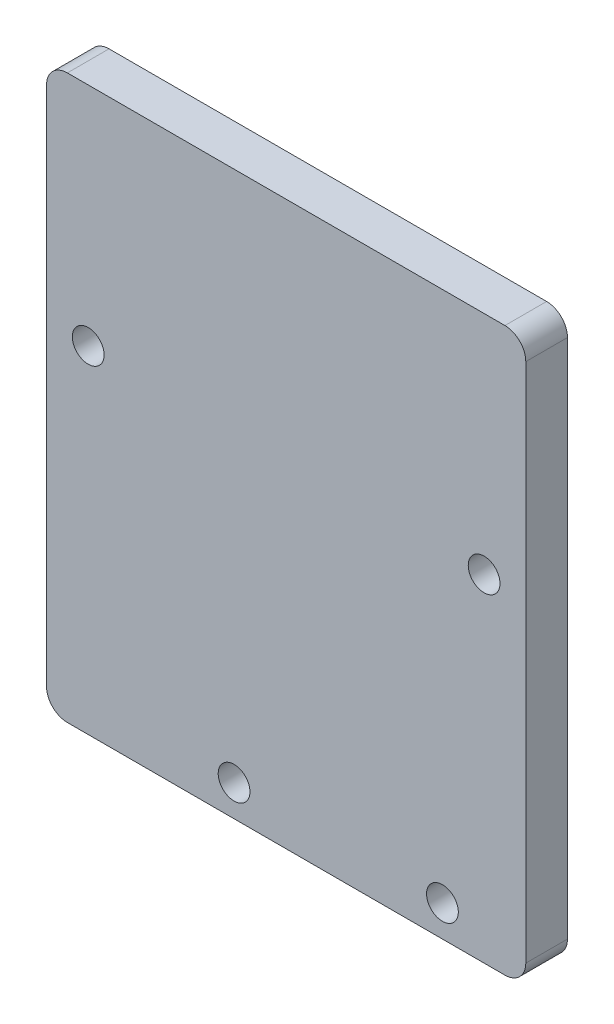
ISO-10303-21;
HEADER;
FILE_DESCRIPTION(('STEP AP214'),'2;1');
FILE_NAME('part.step','',(''),(''),'','','');
FILE_SCHEMA(('AUTOMOTIVE_DESIGN { 1 0 10303 214 1 1 1 1 }'));
ENDSEC;
DATA;
#1=APPLICATION_CONTEXT('core data for automotive mechanical design processes');
#2=APPLICATION_PROTOCOL_DEFINITION('international standard','automotive_design',2000,#1);
#3=PRODUCT_CONTEXT('',#1,'mechanical');
#4=PRODUCT('Part','Part','',(#3));
#5=PRODUCT_RELATED_PRODUCT_CATEGORY('part','',(#4));
#6=PRODUCT_DEFINITION_FORMATION('','',#4);
#7=PRODUCT_DEFINITION_CONTEXT('part definition',#1,'design');
#8=PRODUCT_DEFINITION('design','',#6,#7);
#9=PRODUCT_DEFINITION_SHAPE('','',#8);
#10=(LENGTH_UNIT() NAMED_UNIT(*) SI_UNIT(.MILLI.,.METRE.));
#11=(NAMED_UNIT(*) PLANE_ANGLE_UNIT() SI_UNIT($,.RADIAN.));
#12=(NAMED_UNIT(*) SI_UNIT($,.STERADIAN.) SOLID_ANGLE_UNIT());
#13=UNCERTAINTY_MEASURE_WITH_UNIT(LENGTH_MEASURE(1.E-05),#10,'distance_accuracy_value','');
#14=(GEOMETRIC_REPRESENTATION_CONTEXT(3) GLOBAL_UNCERTAINTY_ASSIGNED_CONTEXT((#13)) GLOBAL_UNIT_ASSIGNED_CONTEXT((#10,
#11,#12)) REPRESENTATION_CONTEXT('',''));
#15=CARTESIAN_POINT('',(0.,0.,0.));
#16=DIRECTION('',(0.,0.,1.));
#17=DIRECTION('',(1.,0.,0.));
#18=AXIS2_PLACEMENT_3D('',#15,#16,#17);
#19=CARTESIAN_POINT('',(23.,-27.,4.));
#20=DIRECTION('',(-1.,0.,0.));
#21=DIRECTION('',(0.,0.,1.));
#22=AXIS2_PLACEMENT_3D('',#19,#20,#21);
#23=PLANE('',#22);
#24=DIRECTION('',(0.,1.,0.));
#25=VECTOR('',#24,1.);
#26=CARTESIAN_POINT('',(23.,-27.,0.));
#27=LINE('',#26,#25);
#28=CARTESIAN_POINT('',(23.,-25.,0.));
#29=VERTEX_POINT('',#28);
#30=CARTESIAN_POINT('',(23.,25.,0.));
#31=VERTEX_POINT('',#30);
#32=EDGE_CURVE('E132',#29,#31,#27,.T.);
#33=ORIENTED_EDGE('',*,*,#32,.T.);
#34=DIRECTION('',(0.,0.,-1.));
#35=VECTOR('',#34,1.);
#36=CARTESIAN_POINT('',(23.,25.,4.));
#37=LINE('',#36,#35);
#38=CARTESIAN_POINT('',(23.,25.,4.));
#39=VERTEX_POINT('',#38);
#40=EDGE_CURVE('E155',#31,#39,#37,.F.);
#41=ORIENTED_EDGE('',*,*,#40,.T.);
#42=DIRECTION('',(0.,1.,0.));
#43=VECTOR('',#42,1.);
#44=CARTESIAN_POINT('',(23.,-27.,4.));
#45=LINE('',#44,#43);
#46=CARTESIAN_POINT('',(23.,-25.,4.));
#47=VERTEX_POINT('',#46);
#48=EDGE_CURVE('E130',#47,#39,#45,.T.);
#49=ORIENTED_EDGE('',*,*,#48,.F.);
#50=DIRECTION('',(0.,0.,-1.));
#51=VECTOR('',#50,1.);
#52=CARTESIAN_POINT('',(23.,-25.,4.));
#53=LINE('',#52,#51);
#54=EDGE_CURVE('E152',#47,#29,#53,.T.);
#55=ORIENTED_EDGE('',*,*,#54,.T.);
#56=EDGE_LOOP('',(#33,#41,#49,#55));
#57=FACE_BOUND('',#56,.T.);
#58=ADVANCED_FACE('F37',(#57),#23,.F.);
#59=CARTESIAN_POINT('',(-23.,27.,4.));
#60=DIRECTION('',(0.,-1.,0.));
#61=DIRECTION('',(0.,0.,-1.));
#62=AXIS2_PLACEMENT_3D('',#59,#60,#61);
#63=PLANE('',#62);
#64=DIRECTION('',(-1.,0.,0.));
#65=VECTOR('',#64,1.);
#66=CARTESIAN_POINT('',(-23.,27.,0.));
#67=LINE('',#66,#65);
#68=CARTESIAN_POINT('',(21.,27.,0.));
#69=VERTEX_POINT('',#68);
#70=CARTESIAN_POINT('',(-21.,27.,0.));
#71=VERTEX_POINT('',#70);
#72=EDGE_CURVE('E128',#69,#71,#67,.T.);
#73=ORIENTED_EDGE('',*,*,#72,.T.);
#74=DIRECTION('',(0.,0.,-1.));
#75=VECTOR('',#74,1.);
#76=CARTESIAN_POINT('',(-21.,27.,4.));
#77=LINE('',#76,#75);
#78=CARTESIAN_POINT('',(-21.,27.,4.));
#79=VERTEX_POINT('',#78);
#80=EDGE_CURVE('E107',#71,#79,#77,.F.);
#81=ORIENTED_EDGE('',*,*,#80,.T.);
#82=DIRECTION('',(-1.,0.,0.));
#83=VECTOR('',#82,1.);
#84=CARTESIAN_POINT('',(-23.,27.,4.));
#85=LINE('',#84,#83);
#86=CARTESIAN_POINT('',(21.,27.,4.));
#87=VERTEX_POINT('',#86);
#88=EDGE_CURVE('E171',#87,#79,#85,.T.);
#89=ORIENTED_EDGE('',*,*,#88,.F.);
#90=DIRECTION('',(0.,0.,-1.));
#91=VECTOR('',#90,1.);
#92=CARTESIAN_POINT('',(21.,27.,4.));
#93=LINE('',#92,#91);
#94=EDGE_CURVE('E112',#87,#69,#93,.T.);
#95=ORIENTED_EDGE('',*,*,#94,.T.);
#96=EDGE_LOOP('',(#73,#81,#89,#95));
#97=FACE_BOUND('',#96,.T.);
#98=ADVANCED_FACE('F228',(#97),#63,.F.);
#99=CARTESIAN_POINT('',(-23.,-27.,4.));
#100=DIRECTION('',(1.,0.,0.));
#101=DIRECTION('',(0.,0.,-1.));
#102=AXIS2_PLACEMENT_3D('',#99,#100,#101);
#103=PLANE('',#102);
#104=DIRECTION('',(0.,-1.,0.));
#105=VECTOR('',#104,1.);
#106=CARTESIAN_POINT('',(-23.,-27.,4.));
#107=LINE('',#106,#105);
#108=CARTESIAN_POINT('',(-23.,25.,4.));
#109=VERTEX_POINT('',#108);
#110=CARTESIAN_POINT('',(-23.,-25.,4.));
#111=VERTEX_POINT('',#110);
#112=EDGE_CURVE('E121',#109,#111,#107,.T.);
#113=ORIENTED_EDGE('',*,*,#112,.F.);
#114=DIRECTION('',(0.,0.,-1.));
#115=VECTOR('',#114,1.);
#116=CARTESIAN_POINT('',(-23.,25.,4.));
#117=LINE('',#116,#115);
#118=CARTESIAN_POINT('',(-23.,25.,0.));
#119=VERTEX_POINT('',#118);
#120=EDGE_CURVE('E106',#109,#119,#117,.T.);
#121=ORIENTED_EDGE('',*,*,#120,.T.);
#122=DIRECTION('',(0.,-1.,0.));
#123=VECTOR('',#122,1.);
#124=CARTESIAN_POINT('',(-23.,-27.,0.));
#125=LINE('',#124,#123);
#126=CARTESIAN_POINT('',(-23.,-25.,0.));
#127=VERTEX_POINT('',#126);
#128=EDGE_CURVE('E119',#119,#127,#125,.T.);
#129=ORIENTED_EDGE('',*,*,#128,.T.);
#130=DIRECTION('',(0.,0.,-1.));
#131=VECTOR('',#130,1.);
#132=CARTESIAN_POINT('',(-23.,-25.,4.));
#133=LINE('',#132,#131);
#134=EDGE_CURVE('E123',#127,#111,#133,.F.);
#135=ORIENTED_EDGE('',*,*,#134,.T.);
#136=EDGE_LOOP('',(#113,#121,#129,#135));
#137=FACE_BOUND('',#136,.T.);
#138=ADVANCED_FACE('F118',(#137),#103,.F.);
#139=CARTESIAN_POINT('',(-23.,-27.,4.));
#140=DIRECTION('',(0.,1.,0.));
#141=DIRECTION('',(0.,0.,1.));
#142=AXIS2_PLACEMENT_3D('',#139,#140,#141);
#143=PLANE('',#142);
#144=DIRECTION('',(1.,0.,0.));
#145=VECTOR('',#144,1.);
#146=CARTESIAN_POINT('',(-23.,-27.,0.));
#147=LINE('',#146,#145);
#148=CARTESIAN_POINT('',(-21.,-27.,0.));
#149=VERTEX_POINT('',#148);
#150=CARTESIAN_POINT('',(21.,-27.,0.));
#151=VERTEX_POINT('',#150);
#152=EDGE_CURVE('E127',#149,#151,#147,.T.);
#153=ORIENTED_EDGE('',*,*,#152,.T.);
#154=DIRECTION('',(0.,0.,-1.));
#155=VECTOR('',#154,1.);
#156=CARTESIAN_POINT('',(21.,-27.,4.));
#157=LINE('',#156,#155);
#158=CARTESIAN_POINT('',(21.,-27.,4.));
#159=VERTEX_POINT('',#158);
#160=EDGE_CURVE('E11',#151,#159,#157,.F.);
#161=ORIENTED_EDGE('',*,*,#160,.T.);
#162=DIRECTION('',(1.,0.,0.));
#163=VECTOR('',#162,1.);
#164=CARTESIAN_POINT('',(-23.,-27.,4.));
#165=LINE('',#164,#163);
#166=CARTESIAN_POINT('',(-21.,-27.,4.));
#167=VERTEX_POINT('',#166);
#168=EDGE_CURVE('E136',#167,#159,#165,.T.);
#169=ORIENTED_EDGE('',*,*,#168,.F.);
#170=DIRECTION('',(0.,0.,-1.));
#171=VECTOR('',#170,1.);
#172=CARTESIAN_POINT('',(-21.,-27.,4.));
#173=LINE('',#172,#171);
#174=EDGE_CURVE('E45',#167,#149,#173,.T.);
#175=ORIENTED_EDGE('',*,*,#174,.T.);
#176=EDGE_LOOP('',(#153,#161,#169,#175));
#177=FACE_BOUND('',#176,.T.);
#178=ADVANCED_FACE('F158',(#177),#143,.F.);
#179=CARTESIAN_POINT('',(0.,0.,4.));
#180=DIRECTION('',(0.,0.,-1.));
#181=DIRECTION('',(-1.,0.,0.));
#182=AXIS2_PLACEMENT_3D('',#179,#180,#181);
#183=PLANE('',#182);
#184=CARTESIAN_POINT('',(-19.,5.31031044755148,4.));
#185=DIRECTION('',(0.,0.,-1.));
#186=DIRECTION('',(-1.,0.,0.));
#187=AXIS2_PLACEMENT_3D('',#184,#185,#186);
#188=CIRCLE('',#187,1.525);
#189=CARTESIAN_POINT('',(-20.525,5.31031044755148,4.));
#190=VERTEX_POINT('',#189);
#191=EDGE_CURVE('E176',#190,#190,#188,.T.);
#192=ORIENTED_EDGE('',*,*,#191,.T.);
#193=EDGE_LOOP('',(#192));
#194=FACE_BOUND('',#193,.T.);
#195=CARTESIAN_POINT('',(19.,5.31031044755147,4.));
#196=DIRECTION('',(0.,0.,-1.));
#197=DIRECTION('',(-1.,0.,0.));
#198=AXIS2_PLACEMENT_3D('',#195,#196,#197);
#199=CIRCLE('',#198,1.525);
#200=CARTESIAN_POINT('',(17.475,5.31031044755147,4.));
#201=VERTEX_POINT('',#200);
#202=EDGE_CURVE('E181',#201,#201,#199,.T.);
#203=ORIENTED_EDGE('',*,*,#202,.T.);
#204=EDGE_LOOP('',(#203));
#205=FACE_BOUND('',#204,.T.);
#206=CARTESIAN_POINT('',(15.,-24.,4.));
#207=DIRECTION('',(0.,0.,-1.));
#208=DIRECTION('',(-1.,0.,0.));
#209=AXIS2_PLACEMENT_3D('',#206,#207,#208);
#210=CIRCLE('',#209,1.525);
#211=CARTESIAN_POINT('',(13.475,-24.,4.));
#212=VERTEX_POINT('',#211);
#213=EDGE_CURVE('E185',#212,#212,#210,.T.);
#214=ORIENTED_EDGE('',*,*,#213,.T.);
#215=EDGE_LOOP('',(#214));
#216=FACE_BOUND('',#215,.T.);
#217=CARTESIAN_POINT('',(-4.99999999999995,-24.,4.));
#218=DIRECTION('',(0.,0.,-1.));
#219=DIRECTION('',(-1.,0.,0.));
#220=AXIS2_PLACEMENT_3D('',#217,#218,#219);
#221=CIRCLE('',#220,1.525);
#222=CARTESIAN_POINT('',(-6.52499999999995,-24.,4.));
#223=VERTEX_POINT('',#222);
#224=EDGE_CURVE('E189',#223,#223,#221,.T.);
#225=ORIENTED_EDGE('',*,*,#224,.T.);
#226=EDGE_LOOP('',(#225));
#227=FACE_BOUND('',#226,.T.);
#228=ORIENTED_EDGE('',*,*,#88,.T.);
#229=CARTESIAN_POINT('',(-21.,25.,4.));
#230=DIRECTION('',(0.,0.,-1.));
#231=DIRECTION('',(-1.,0.,0.));
#232=AXIS2_PLACEMENT_3D('',#229,#230,#231);
#233=CIRCLE('',#232,2.);
#234=EDGE_CURVE('E150',#79,#109,#233,.F.);
#235=ORIENTED_EDGE('',*,*,#234,.T.);
#236=ORIENTED_EDGE('',*,*,#112,.T.);
#237=CARTESIAN_POINT('',(-21.,-25.,4.));
#238=DIRECTION('',(0.,0.,-1.));
#239=DIRECTION('',(-1.,0.,0.));
#240=AXIS2_PLACEMENT_3D('',#237,#238,#239);
#241=CIRCLE('',#240,2.);
#242=EDGE_CURVE('E57',#111,#167,#241,.F.);
#243=ORIENTED_EDGE('',*,*,#242,.T.);
#244=ORIENTED_EDGE('',*,*,#168,.T.);
#245=CARTESIAN_POINT('',(21.,-25.,4.));
#246=DIRECTION('',(0.,0.,-1.));
#247=DIRECTION('',(-1.,0.,0.));
#248=AXIS2_PLACEMENT_3D('',#245,#246,#247);
#249=CIRCLE('',#248,2.);
#250=EDGE_CURVE('E146',#159,#47,#249,.F.);
#251=ORIENTED_EDGE('',*,*,#250,.T.);
#252=ORIENTED_EDGE('',*,*,#48,.T.);
#253=CARTESIAN_POINT('',(21.,25.,4.));
#254=DIRECTION('',(0.,0.,-1.));
#255=DIRECTION('',(-1.,0.,0.));
#256=AXIS2_PLACEMENT_3D('',#253,#254,#255);
#257=CIRCLE('',#256,2.);
#258=EDGE_CURVE('E148',#39,#87,#257,.F.);
#259=ORIENTED_EDGE('',*,*,#258,.T.);
#260=EDGE_LOOP('',(#228,#235,#236,#243,#244,#251,#252,#259));
#261=FACE_BOUND('',#260,.T.);
#262=ADVANCED_FACE('F213',(#194,#205,#216,#227,#261),#183,.F.);
#263=CARTESIAN_POINT('',(0.,0.,0.));
#264=DIRECTION('',(0.,0.,-1.));
#265=DIRECTION('',(-1.,0.,0.));
#266=AXIS2_PLACEMENT_3D('',#263,#264,#265);
#267=PLANE('',#266);
#268=CARTESIAN_POINT('',(-19.,5.31031044755148,0.));
#269=DIRECTION('',(0.,0.,-1.));
#270=DIRECTION('',(-1.,0.,0.));
#271=AXIS2_PLACEMENT_3D('',#268,#269,#270);
#272=CIRCLE('',#271,1.525);
#273=CARTESIAN_POINT('',(-20.525,5.31031044755148,0.));
#274=VERTEX_POINT('',#273);
#275=EDGE_CURVE('E198',#274,#274,#272,.T.);
#276=ORIENTED_EDGE('',*,*,#275,.F.);
#277=EDGE_LOOP('',(#276));
#278=FACE_BOUND('',#277,.T.);
#279=CARTESIAN_POINT('',(19.,5.31031044755147,0.));
#280=DIRECTION('',(0.,0.,-1.));
#281=DIRECTION('',(-1.,0.,0.));
#282=AXIS2_PLACEMENT_3D('',#279,#280,#281);
#283=CIRCLE('',#282,1.525);
#284=CARTESIAN_POINT('',(17.475,5.31031044755147,0.));
#285=VERTEX_POINT('',#284);
#286=EDGE_CURVE('E201',#285,#285,#283,.T.);
#287=ORIENTED_EDGE('',*,*,#286,.F.);
#288=EDGE_LOOP('',(#287));
#289=FACE_BOUND('',#288,.T.);
#290=CARTESIAN_POINT('',(15.,-24.,0.));
#291=DIRECTION('',(0.,0.,-1.));
#292=DIRECTION('',(-1.,0.,0.));
#293=AXIS2_PLACEMENT_3D('',#290,#291,#292);
#294=CIRCLE('',#293,1.525);
#295=CARTESIAN_POINT('',(13.475,-24.,0.));
#296=VERTEX_POINT('',#295);
#297=EDGE_CURVE('E197',#296,#296,#294,.T.);
#298=ORIENTED_EDGE('',*,*,#297,.F.);
#299=EDGE_LOOP('',(#298));
#300=FACE_BOUND('',#299,.T.);
#301=CARTESIAN_POINT('',(-4.99999999999995,-24.,0.));
#302=DIRECTION('',(0.,0.,-1.));
#303=DIRECTION('',(-1.,0.,0.));
#304=AXIS2_PLACEMENT_3D('',#301,#302,#303);
#305=CIRCLE('',#304,1.525);
#306=CARTESIAN_POINT('',(-6.52499999999995,-24.,0.));
#307=VERTEX_POINT('',#306);
#308=EDGE_CURVE('E194',#307,#307,#305,.T.);
#309=ORIENTED_EDGE('',*,*,#308,.F.);
#310=EDGE_LOOP('',(#309));
#311=FACE_BOUND('',#310,.T.);
#312=ORIENTED_EDGE('',*,*,#128,.F.);
#313=CARTESIAN_POINT('',(-21.,25.,0.));
#314=DIRECTION('',(0.,0.,-1.));
#315=DIRECTION('',(-1.,0.,0.));
#316=AXIS2_PLACEMENT_3D('',#313,#314,#315);
#317=CIRCLE('',#316,2.);
#318=EDGE_CURVE('E102',#119,#71,#317,.T.);
#319=ORIENTED_EDGE('',*,*,#318,.T.);
#320=ORIENTED_EDGE('',*,*,#72,.F.);
#321=CARTESIAN_POINT('',(21.,25.,0.));
#322=DIRECTION('',(0.,0.,-1.));
#323=DIRECTION('',(-1.,0.,0.));
#324=AXIS2_PLACEMENT_3D('',#321,#322,#323);
#325=CIRCLE('',#324,2.);
#326=EDGE_CURVE('E113',#69,#31,#325,.T.);
#327=ORIENTED_EDGE('',*,*,#326,.T.);
#328=ORIENTED_EDGE('',*,*,#32,.F.);
#329=CARTESIAN_POINT('',(21.,-25.,0.));
#330=DIRECTION('',(0.,0.,-1.));
#331=DIRECTION('',(-1.,0.,0.));
#332=AXIS2_PLACEMENT_3D('',#329,#330,#331);
#333=CIRCLE('',#332,2.);
#334=EDGE_CURVE('E139',#29,#151,#333,.T.);
#335=ORIENTED_EDGE('',*,*,#334,.T.);
#336=ORIENTED_EDGE('',*,*,#152,.F.);
#337=CARTESIAN_POINT('',(-21.,-25.,0.));
#338=DIRECTION('',(0.,0.,-1.));
#339=DIRECTION('',(-1.,0.,0.));
#340=AXIS2_PLACEMENT_3D('',#337,#338,#339);
#341=CIRCLE('',#340,2.);
#342=EDGE_CURVE('E122',#149,#127,#341,.T.);
#343=ORIENTED_EDGE('',*,*,#342,.T.);
#344=EDGE_LOOP('',(#312,#319,#320,#327,#328,#335,#336,#343));
#345=FACE_BOUND('',#344,.T.);
#346=ADVANCED_FACE('F125',(#278,#289,#300,#311,#345),#267,.T.);
#347=CARTESIAN_POINT('',(-4.99999999999995,-24.,54.));
#348=DIRECTION('',(0.,0.,-1.));
#349=DIRECTION('',(-1.,0.,0.));
#350=AXIS2_PLACEMENT_3D('',#347,#348,#349);
#351=CYLINDRICAL_SURFACE('',#350,1.525);
#352=ORIENTED_EDGE('',*,*,#308,.T.);
#353=EDGE_LOOP('',(#352));
#354=FACE_BOUND('',#353,.T.);
#355=ORIENTED_EDGE('',*,*,#224,.F.);
#356=EDGE_LOOP('',(#355));
#357=FACE_BOUND('',#356,.T.);
#358=ADVANCED_FACE('F212',(#354,#357),#351,.F.);
#359=CARTESIAN_POINT('',(15.,-24.,54.));
#360=DIRECTION('',(0.,0.,-1.));
#361=DIRECTION('',(-1.,0.,0.));
#362=AXIS2_PLACEMENT_3D('',#359,#360,#361);
#363=CYLINDRICAL_SURFACE('',#362,1.525);
#364=ORIENTED_EDGE('',*,*,#297,.T.);
#365=EDGE_LOOP('',(#364));
#366=FACE_BOUND('',#365,.T.);
#367=ORIENTED_EDGE('',*,*,#213,.F.);
#368=EDGE_LOOP('',(#367));
#369=FACE_BOUND('',#368,.T.);
#370=ADVANCED_FACE('F207',(#366,#369),#363,.F.);
#371=CARTESIAN_POINT('',(19.,5.31031044755147,54.));
#372=DIRECTION('',(0.,0.,-1.));
#373=DIRECTION('',(-1.,0.,0.));
#374=AXIS2_PLACEMENT_3D('',#371,#372,#373);
#375=CYLINDRICAL_SURFACE('',#374,1.525);
#376=ORIENTED_EDGE('',*,*,#286,.T.);
#377=EDGE_LOOP('',(#376));
#378=FACE_BOUND('',#377,.T.);
#379=ORIENTED_EDGE('',*,*,#202,.F.);
#380=EDGE_LOOP('',(#379));
#381=FACE_BOUND('',#380,.T.);
#382=ADVANCED_FACE('F253',(#378,#381),#375,.F.);
#383=CARTESIAN_POINT('',(-19.,5.31031044755148,54.));
#384=DIRECTION('',(0.,0.,-1.));
#385=DIRECTION('',(-1.,0.,0.));
#386=AXIS2_PLACEMENT_3D('',#383,#384,#385);
#387=CYLINDRICAL_SURFACE('',#386,1.525);
#388=ORIENTED_EDGE('',*,*,#275,.T.);
#389=EDGE_LOOP('',(#388));
#390=FACE_BOUND('',#389,.T.);
#391=ORIENTED_EDGE('',*,*,#191,.F.);
#392=EDGE_LOOP('',(#391));
#393=FACE_BOUND('',#392,.T.);
#394=ADVANCED_FACE('F237',(#390,#393),#387,.F.);
#395=CARTESIAN_POINT('',(-21.,25.,4.));
#396=DIRECTION('',(0.,0.,-1.));
#397=DIRECTION('',(-1.,0.,0.));
#398=AXIS2_PLACEMENT_3D('',#395,#396,#397);
#399=CYLINDRICAL_SURFACE('',#398,2.);
#400=ORIENTED_EDGE('',*,*,#234,.F.);
#401=ORIENTED_EDGE('',*,*,#80,.F.);
#402=ORIENTED_EDGE('',*,*,#318,.F.);
#403=ORIENTED_EDGE('',*,*,#120,.F.);
#404=EDGE_LOOP('',(#400,#401,#402,#403));
#405=FACE_BOUND('',#404,.T.);
#406=ADVANCED_FACE('F105',(#405),#399,.T.);
#407=CARTESIAN_POINT('',(21.,25.,4.));
#408=DIRECTION('',(0.,0.,-1.));
#409=DIRECTION('',(-1.,0.,0.));
#410=AXIS2_PLACEMENT_3D('',#407,#408,#409);
#411=CYLINDRICAL_SURFACE('',#410,2.);
#412=ORIENTED_EDGE('',*,*,#258,.F.);
#413=ORIENTED_EDGE('',*,*,#40,.F.);
#414=ORIENTED_EDGE('',*,*,#326,.F.);
#415=ORIENTED_EDGE('',*,*,#94,.F.);
#416=EDGE_LOOP('',(#412,#413,#414,#415));
#417=FACE_BOUND('',#416,.T.);
#418=ADVANCED_FACE('F230',(#417),#411,.T.);
#419=CARTESIAN_POINT('',(21.,-25.,4.));
#420=DIRECTION('',(0.,0.,-1.));
#421=DIRECTION('',(-1.,0.,0.));
#422=AXIS2_PLACEMENT_3D('',#419,#420,#421);
#423=CYLINDRICAL_SURFACE('',#422,2.);
#424=ORIENTED_EDGE('',*,*,#250,.F.);
#425=ORIENTED_EDGE('',*,*,#160,.F.);
#426=ORIENTED_EDGE('',*,*,#334,.F.);
#427=ORIENTED_EDGE('',*,*,#54,.F.);
#428=EDGE_LOOP('',(#424,#425,#426,#427));
#429=FACE_BOUND('',#428,.T.);
#430=ADVANCED_FACE('F165',(#429),#423,.T.);
#431=CARTESIAN_POINT('',(-21.,-25.,4.));
#432=DIRECTION('',(0.,0.,-1.));
#433=DIRECTION('',(-1.,0.,0.));
#434=AXIS2_PLACEMENT_3D('',#431,#432,#433);
#435=CYLINDRICAL_SURFACE('',#434,2.);
#436=ORIENTED_EDGE('',*,*,#242,.F.);
#437=ORIENTED_EDGE('',*,*,#134,.F.);
#438=ORIENTED_EDGE('',*,*,#342,.F.);
#439=ORIENTED_EDGE('',*,*,#174,.F.);
#440=EDGE_LOOP('',(#436,#437,#438,#439));
#441=FACE_BOUND('',#440,.T.);
#442=ADVANCED_FACE('F39',(#441),#435,.T.);
#443=CLOSED_SHELL('',(#58,#98,#138,#178,#262,#346,#358,#370,#382,#394,#406,#418,#430,#442));
#444=MANIFOLD_SOLID_BREP('B2',#443);
#445=ADVANCED_BREP_SHAPE_REPRESENTATION('',(#18,#444),#14);
#446=SHAPE_DEFINITION_REPRESENTATION(#9,#445);
ENDSEC;
END-ISO-10303-21;
